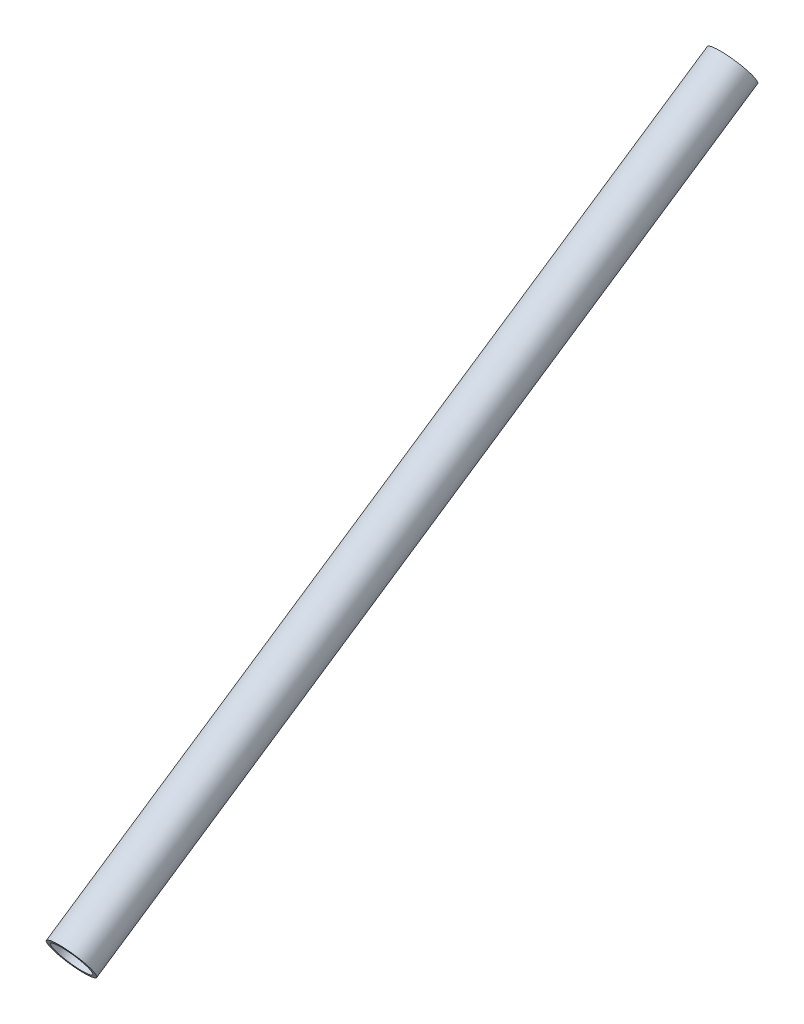
ISO-10303-21;
HEADER;
FILE_DESCRIPTION(('STEP AP214'),'2;1');
FILE_NAME('part.step','',(''),(''),'','','');
FILE_SCHEMA(('AUTOMOTIVE_DESIGN { 1 0 10303 214 1 1 1 1 }'));
ENDSEC;
DATA;
#1=APPLICATION_CONTEXT('core data for automotive mechanical design processes');
#2=APPLICATION_PROTOCOL_DEFINITION('international standard','automotive_design',2000,#1);
#3=PRODUCT_CONTEXT('',#1,'mechanical');
#4=PRODUCT('Part','Part','',(#3));
#5=PRODUCT_RELATED_PRODUCT_CATEGORY('part','',(#4));
#6=PRODUCT_DEFINITION_FORMATION('','',#4);
#7=PRODUCT_DEFINITION_CONTEXT('part definition',#1,'design');
#8=PRODUCT_DEFINITION('design','',#6,#7);
#9=PRODUCT_DEFINITION_SHAPE('','',#8);
#10=(LENGTH_UNIT() NAMED_UNIT(*) SI_UNIT(.MILLI.,.METRE.));
#11=(NAMED_UNIT(*) PLANE_ANGLE_UNIT() SI_UNIT($,.RADIAN.));
#12=(NAMED_UNIT(*) SI_UNIT($,.STERADIAN.) SOLID_ANGLE_UNIT());
#13=UNCERTAINTY_MEASURE_WITH_UNIT(LENGTH_MEASURE(1.E-05),#10,'distance_accuracy_value','');
#14=(GEOMETRIC_REPRESENTATION_CONTEXT(3) GLOBAL_UNCERTAINTY_ASSIGNED_CONTEXT((#13)) GLOBAL_UNIT_ASSIGNED_CONTEXT((#10,
#11,#12)) REPRESENTATION_CONTEXT('',''));
#15=CARTESIAN_POINT('',(0.,0.,0.));
#16=DIRECTION('',(0.,0.,1.));
#17=DIRECTION('',(1.,0.,0.));
#18=AXIS2_PLACEMENT_3D('',#15,#16,#17);
#19=CARTESIAN_POINT('',(0.,314.963155535699,400.115494159076));
#20=DIRECTION('',(0.,0.557351153495909,-0.830276876527812));
#21=DIRECTION('',(0.,0.830276876527812,0.557351153495909));
#22=AXIS2_PLACEMENT_3D('',#19,#20,#21);
#23=CYLINDRICAL_SURFACE('',#22,6.6929);
#24=CARTESIAN_POINT('',(0.,314.963155535699,400.115494159076));
#25=DIRECTION('',(0.,-0.557351153495909,0.830276876527812));
#26=DIRECTION('',(0.,-0.830276876527812,-0.557351153495909));
#27=AXIS2_PLACEMENT_3D('',#24,#25,#26);
#28=CIRCLE('',#27,6.6929);
#29=CARTESIAN_POINT('',(0.,309.406195428786,396.385198623843));
#30=VERTEX_POINT('',#29);
#31=EDGE_CURVE('E48',#30,#30,#28,.T.);
#32=ORIENTED_EDGE('',*,*,#31,.T.);
#33=EDGE_LOOP('',(#32));
#34=FACE_BOUND('',#33,.T.);
#35=CARTESIAN_POINT('',(0.,474.175023270355,162.940184805634));
#36=DIRECTION('',(0.,-0.557351153495909,0.830276876527812));
#37=DIRECTION('',(0.,-0.830276876527812,-0.557351153495909));
#38=AXIS2_PLACEMENT_3D('',#35,#36,#37);
#39=CIRCLE('',#38,6.6929);
#40=CARTESIAN_POINT('',(0.,468.618063163442,159.209889270401));
#41=VERTEX_POINT('',#40);
#42=EDGE_CURVE('E54',#41,#41,#39,.T.);
#43=ORIENTED_EDGE('',*,*,#42,.F.);
#44=EDGE_LOOP('',(#43));
#45=FACE_BOUND('',#44,.T.);
#46=ADVANCED_FACE('F41',(#34,#45),#23,.F.);
#47=CARTESIAN_POINT('',(0.,314.963155535699,400.115494159076));
#48=DIRECTION('',(0.,0.557351153495909,-0.830276876527812));
#49=DIRECTION('',(0.,0.830276876527812,0.557351153495909));
#50=AXIS2_PLACEMENT_3D('',#47,#48,#49);
#51=CYLINDRICAL_SURFACE('',#50,7.93749999999999);
#52=CARTESIAN_POINT('',(0.,314.963155535699,400.115494159076));
#53=DIRECTION('',(0.,-0.557351153495909,0.830276876527812));
#54=DIRECTION('',(0.,-0.830276876527812,-0.557351153495909));
#55=AXIS2_PLACEMENT_3D('',#52,#53,#54);
#56=CIRCLE('',#55,7.93749999999999);
#57=CARTESIAN_POINT('',(0.,308.372832828259,395.691519378202));
#58=VERTEX_POINT('',#57);
#59=EDGE_CURVE('E11',#58,#58,#56,.T.);
#60=ORIENTED_EDGE('',*,*,#59,.F.);
#61=EDGE_LOOP('',(#60));
#62=FACE_BOUND('',#61,.T.);
#63=CARTESIAN_POINT('',(0.,474.175023270355,162.940184805634));
#64=DIRECTION('',(0.,-0.557351153495909,0.830276876527812));
#65=DIRECTION('',(0.,-0.830276876527812,-0.557351153495909));
#66=AXIS2_PLACEMENT_3D('',#63,#64,#65);
#67=CIRCLE('',#66,7.93749999999999);
#68=CARTESIAN_POINT('',(0.,467.584700562916,158.51621002476));
#69=VERTEX_POINT('',#68);
#70=EDGE_CURVE('E44',#69,#69,#67,.T.);
#71=ORIENTED_EDGE('',*,*,#70,.T.);
#72=EDGE_LOOP('',(#71));
#73=FACE_BOUND('',#72,.T.);
#74=ADVANCED_FACE('F61',(#62,#73),#51,.T.);
#75=CARTESIAN_POINT('',(0.,314.963155535699,400.115494159076));
#76=DIRECTION('',(0.,-0.557351153495909,0.830276876527812));
#77=DIRECTION('',(0.,-0.830276876527812,-0.557351153495909));
#78=AXIS2_PLACEMENT_3D('',#75,#76,#77);
#79=PLANE('',#78);
#80=ORIENTED_EDGE('',*,*,#31,.F.);
#81=EDGE_LOOP('',(#80));
#82=FACE_BOUND('',#81,.T.);
#83=ORIENTED_EDGE('',*,*,#59,.T.);
#84=EDGE_LOOP('',(#83));
#85=FACE_BOUND('',#84,.T.);
#86=ADVANCED_FACE('F65',(#82,#85),#79,.T.);
#87=CARTESIAN_POINT('',(0.,474.175023270355,162.940184805634));
#88=DIRECTION('',(0.,-0.557351153495909,0.830276876527812));
#89=DIRECTION('',(0.,-0.830276876527812,-0.557351153495909));
#90=AXIS2_PLACEMENT_3D('',#87,#88,#89);
#91=PLANE('',#90);
#92=ORIENTED_EDGE('',*,*,#42,.T.);
#93=EDGE_LOOP('',(#92));
#94=FACE_BOUND('',#93,.T.);
#95=ORIENTED_EDGE('',*,*,#70,.F.);
#96=EDGE_LOOP('',(#95));
#97=FACE_BOUND('',#96,.T.);
#98=ADVANCED_FACE('F63',(#94,#97),#91,.F.);
#99=CLOSED_SHELL('',(#46,#74,#86,#98));
#100=MANIFOLD_SOLID_BREP('B2',#99);
#101=ADVANCED_BREP_SHAPE_REPRESENTATION('',(#18,#100),#14);
#102=SHAPE_DEFINITION_REPRESENTATION(#9,#101);
ENDSEC;
END-ISO-10303-21;
